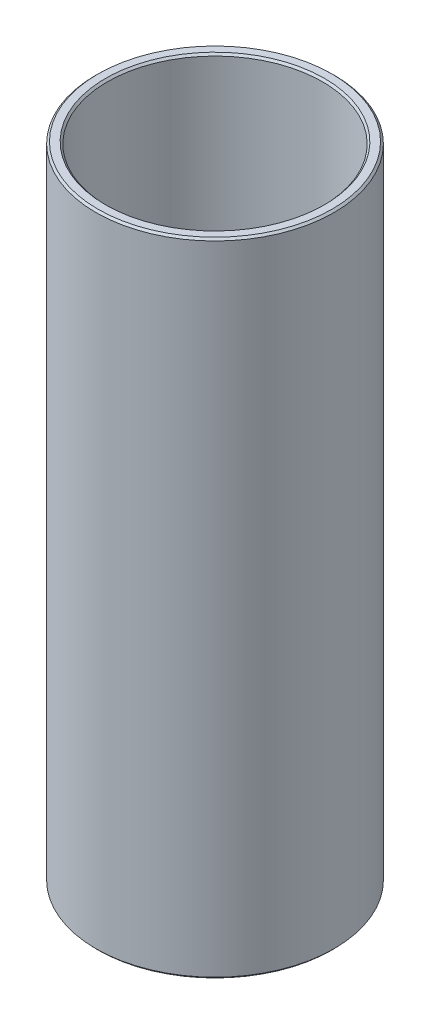
ISO-10303-21;
HEADER;
FILE_DESCRIPTION(('STEP AP214'),'2;1');
FILE_NAME('part.step','',(''),(''),'','','');
FILE_SCHEMA(('AUTOMOTIVE_DESIGN { 1 0 10303 214 1 1 1 1 }'));
ENDSEC;
DATA;
#1=APPLICATION_CONTEXT('core data for automotive mechanical design processes');
#2=APPLICATION_PROTOCOL_DEFINITION('international standard','automotive_design',2000,#1);
#3=PRODUCT_CONTEXT('',#1,'mechanical');
#4=PRODUCT('Part','Part','',(#3));
#5=PRODUCT_RELATED_PRODUCT_CATEGORY('part','',(#4));
#6=PRODUCT_DEFINITION_FORMATION('','',#4);
#7=PRODUCT_DEFINITION_CONTEXT('part definition',#1,'design');
#8=PRODUCT_DEFINITION('design','',#6,#7);
#9=PRODUCT_DEFINITION_SHAPE('','',#8);
#10=(LENGTH_UNIT() NAMED_UNIT(*) SI_UNIT(.MILLI.,.METRE.));
#11=(NAMED_UNIT(*) PLANE_ANGLE_UNIT() SI_UNIT($,.RADIAN.));
#12=(NAMED_UNIT(*) SI_UNIT($,.STERADIAN.) SOLID_ANGLE_UNIT());
#13=UNCERTAINTY_MEASURE_WITH_UNIT(LENGTH_MEASURE(1.E-05),#10,'distance_accuracy_value','');
#14=(GEOMETRIC_REPRESENTATION_CONTEXT(3) GLOBAL_UNCERTAINTY_ASSIGNED_CONTEXT((#13)) GLOBAL_UNIT_ASSIGNED_CONTEXT((#10,
#11,#12)) REPRESENTATION_CONTEXT('',''));
#15=CARTESIAN_POINT('',(0.,0.,0.));
#16=DIRECTION('',(0.,0.,1.));
#17=DIRECTION('',(1.,0.,0.));
#18=AXIS2_PLACEMENT_3D('',#15,#16,#17);
#19=CARTESIAN_POINT('',(0.,269.324814247525,0.));
#20=DIRECTION('',(0.,-1.,0.));
#21=DIRECTION('',(0.,0.,-1.));
#22=AXIS2_PLACEMENT_3D('',#19,#20,#21);
#23=CYLINDRICAL_SURFACE('',#22,50.);
#24=CARTESIAN_POINT('',(0.,0.845228539929521,0.));
#25=DIRECTION('',(0.,1.,0.));
#26=DIRECTION('',(0.,0.,1.));
#27=AXIS2_PLACEMENT_3D('',#24,#25,#26);
#28=CIRCLE('',#27,50.);
#29=CARTESIAN_POINT('',(0.,0.845228539929521,50.));
#30=VERTEX_POINT('',#29);
#31=EDGE_CURVE('E10',#30,#30,#28,.T.);
#32=ORIENTED_EDGE('',*,*,#31,.T.);
#33=EDGE_LOOP('',(#32));
#34=FACE_BOUND('',#33,.T.);
#35=CARTESIAN_POINT('',(0.,268.526705050286,0.));
#36=DIRECTION('',(0.,1.,0.));
#37=DIRECTION('',(0.,0.,1.));
#38=AXIS2_PLACEMENT_3D('',#35,#36,#37);
#39=CIRCLE('',#38,50.);
#40=CARTESIAN_POINT('',(0.,268.526705050286,-50.));
#41=VERTEX_POINT('',#40);
#42=EDGE_CURVE('E50',#41,#41,#39,.F.);
#43=ORIENTED_EDGE('',*,*,#42,.T.);
#44=EDGE_LOOP('',(#43));
#45=FACE_BOUND('',#44,.T.);
#46=ADVANCED_FACE('F39',(#34,#45),#23,.T.);
#47=CARTESIAN_POINT('',(0.,269.324814247525,0.));
#48=DIRECTION('',(0.,1.,0.));
#49=DIRECTION('',(0.,0.,1.));
#50=AXIS2_PLACEMENT_3D('',#47,#48,#49);
#51=PLANE('',#50);
#52=CARTESIAN_POINT('',(0.,269.324814247525,0.));
#53=DIRECTION('',(0.,1.,0.));
#54=DIRECTION('',(0.,0.,1.));
#55=AXIS2_PLACEMENT_3D('',#52,#53,#54);
#56=CIRCLE('',#55,45.9864678372641);
#57=CARTESIAN_POINT('',(0.,269.324814247525,45.986467837264));
#58=VERTEX_POINT('',#57);
#59=EDGE_CURVE('E58',#58,#58,#56,.F.);
#60=ORIENTED_EDGE('',*,*,#59,.T.);
#61=EDGE_LOOP('',(#60));
#62=FACE_BOUND('',#61,.T.);
#63=CARTESIAN_POINT('',(0.,269.324814247525,0.));
#64=DIRECTION('',(0.,1.,0.));
#65=DIRECTION('',(0.,0.,1.));
#66=AXIS2_PLACEMENT_3D('',#63,#64,#65);
#67=CIRCLE('',#66,49.1547714600705);
#68=CARTESIAN_POINT('',(0.,269.324814247525,-49.1547714600705));
#69=VERTEX_POINT('',#68);
#70=EDGE_CURVE('E61',#69,#69,#67,.T.);
#71=ORIENTED_EDGE('',*,*,#70,.T.);
#72=EDGE_LOOP('',(#71));
#73=FACE_BOUND('',#72,.T.);
#74=ADVANCED_FACE('F88',(#62,#73),#51,.T.);
#75=CARTESIAN_POINT('',(0.,0.,0.));
#76=DIRECTION('',(0.,1.,0.));
#77=DIRECTION('',(0.,0.,1.));
#78=AXIS2_PLACEMENT_3D('',#75,#76,#77);
#79=PLANE('',#78);
#80=CARTESIAN_POINT('',(0.,0.,0.));
#81=DIRECTION('',(0.,1.,0.));
#82=DIRECTION('',(0.,0.,1.));
#83=AXIS2_PLACEMENT_3D('',#80,#81,#82);
#84=CIRCLE('',#83,46.0335871799544);
#85=CARTESIAN_POINT('',(0.,0.,46.0335871799544));
#86=VERTEX_POINT('',#85);
#87=EDGE_CURVE('E51',#86,#86,#84,.T.);
#88=ORIENTED_EDGE('',*,*,#87,.T.);
#89=EDGE_LOOP('',(#88));
#90=FACE_BOUND('',#89,.T.);
#91=CARTESIAN_POINT('',(0.,0.,0.));
#92=DIRECTION('',(0.,1.,0.));
#93=DIRECTION('',(0.,0.,1.));
#94=AXIS2_PLACEMENT_3D('',#91,#92,#93);
#95=CIRCLE('',#94,49.2018908027608);
#96=CARTESIAN_POINT('',(0.,0.,49.2018908027608));
#97=VERTEX_POINT('',#96);
#98=EDGE_CURVE('E54',#97,#97,#95,.F.);
#99=ORIENTED_EDGE('',*,*,#98,.T.);
#100=EDGE_LOOP('',(#99));
#101=FACE_BOUND('',#100,.T.);
#102=ADVANCED_FACE('F83',(#90,#101),#79,.F.);
#103=CARTESIAN_POINT('',(0.,269.324814247525,0.));
#104=DIRECTION('',(0.,-1.,0.));
#105=DIRECTION('',(0.,0.,-1.));
#106=AXIS2_PLACEMENT_3D('',#103,#104,#105);
#107=CYLINDRICAL_SURFACE('',#106,45.1883586400248);
#108=CARTESIAN_POINT('',(0.,268.479585707596,0.));
#109=DIRECTION('',(0.,1.,0.));
#110=DIRECTION('',(0.,0.,1.));
#111=AXIS2_PLACEMENT_3D('',#108,#109,#110);
#112=CIRCLE('',#111,45.1883586400248);
#113=CARTESIAN_POINT('',(0.,268.479585707596,45.1883586400248));
#114=VERTEX_POINT('',#113);
#115=EDGE_CURVE('E67',#114,#114,#112,.T.);
#116=ORIENTED_EDGE('',*,*,#115,.T.);
#117=EDGE_LOOP('',(#116));
#118=FACE_BOUND('',#117,.T.);
#119=CARTESIAN_POINT('',(0.,0.798109197239161,0.));
#120=DIRECTION('',(0.,1.,0.));
#121=DIRECTION('',(0.,0.,1.));
#122=AXIS2_PLACEMENT_3D('',#119,#120,#121);
#123=CIRCLE('',#122,45.1883586400248);
#124=CARTESIAN_POINT('',(0.,0.798109197239161,45.1883586400248));
#125=VERTEX_POINT('',#124);
#126=EDGE_CURVE('E69',#125,#125,#123,.F.);
#127=ORIENTED_EDGE('',*,*,#126,.T.);
#128=EDGE_LOOP('',(#127));
#129=FACE_BOUND('',#128,.T.);
#130=ADVANCED_FACE('F71',(#118,#129),#107,.F.);
#131=CARTESIAN_POINT('',(0.,268.479585707596,0.));
#132=DIRECTION('',(0.,1.,0.));
#133=DIRECTION('',(0.,0.,1.));
#134=AXIS2_PLACEMENT_3D('',#131,#132,#133);
#135=CONICAL_SURFACE('',#134,45.1883586400248,0.756733066064484);
#136=CARTESIAN_POINT('',(0.,269.324814247525,45.986467837264));
#137=CARTESIAN_POINT('',(0.,269.316009783568,45.9781541997928));
#138=CARTESIAN_POINT('',(0.,269.30720531961,45.9698405623216));
#139=CARTESIAN_POINT('',(0.,269.289596391695,45.9532132873791));
#140=CARTESIAN_POINT('',(0.,269.280791927737,45.9448996499078));
#141=CARTESIAN_POINT('',(0.,269.263182999822,45.9282723749654));
#142=CARTESIAN_POINT('',(0.,269.254378535865,45.9199587374941));
#143=CARTESIAN_POINT('',(0.,269.236769607949,45.9033314625516));
#144=CARTESIAN_POINT('',(0.,269.227965143992,45.8950178250804));
#145=CARTESIAN_POINT('',(0.,269.210356216077,45.8783905501379));
#146=CARTESIAN_POINT('',(0.,269.201551752119,45.8700769126667));
#147=CARTESIAN_POINT('',(0.,269.183942824204,45.8534496377242));
#148=CARTESIAN_POINT('',(0.,269.175138360246,45.8451360002529));
#149=CARTESIAN_POINT('',(0.,269.157529432331,45.8285087253104));
#150=CARTESIAN_POINT('',(0.,269.148724968373,45.8201950878392));
#151=CARTESIAN_POINT('',(0.,269.131116040458,45.8035678128967));
#152=CARTESIAN_POINT('',(0.,269.122311576501,45.7952541754255));
#153=CARTESIAN_POINT('',(0.,269.104702648585,45.778626900483));
#154=CARTESIAN_POINT('',(0.,269.095898184628,45.7703132630117));
#155=CARTESIAN_POINT('',(0.,269.078289256713,45.7536859880693));
#156=CARTESIAN_POINT('',(0.,269.069484792755,45.745372350598));
#157=CARTESIAN_POINT('',(0.,269.05187586484,45.7287450756555));
#158=CARTESIAN_POINT('',(0.,269.043071400882,45.7204314381843));
#159=CARTESIAN_POINT('',(0.,269.025462472967,45.7038041632418));
#160=CARTESIAN_POINT('',(0.,269.016658009009,45.6954905257706));
#161=CARTESIAN_POINT('',(0.,268.999049081094,45.6788632508281));
#162=CARTESIAN_POINT('',(0.,268.990244617137,45.6705496133568));
#163=CARTESIAN_POINT('',(0.,268.972635689221,45.6539223384144));
#164=CARTESIAN_POINT('',(0.,268.963831225264,45.6456087009431));
#165=CARTESIAN_POINT('',(0.,268.946222297349,45.6289814260006));
#166=CARTESIAN_POINT('',(0.,268.937417833391,45.6206677885294));
#167=CARTESIAN_POINT('',(0.,268.919808905476,45.6040405135869));
#168=CARTESIAN_POINT('',(0.,268.911004441518,45.5957268761157));
#169=CARTESIAN_POINT('',(0.,268.893395513603,45.5790996011732));
#170=CARTESIAN_POINT('',(0.,268.884591049645,45.5707859637019));
#171=CARTESIAN_POINT('',(0.,268.86698212173,45.5541586887595));
#172=CARTESIAN_POINT('',(0.,268.858177657773,45.5458450512882));
#173=CARTESIAN_POINT('',(0.,268.840568729857,45.5292177763457));
#174=CARTESIAN_POINT('',(0.,268.8317642659,45.5209041388745));
#175=CARTESIAN_POINT('',(0.,268.814155337985,45.504276863932));
#176=CARTESIAN_POINT('',(0.,268.805350874027,45.4959632264608));
#177=CARTESIAN_POINT('',(0.,268.787741946112,45.4793359515183));
#178=CARTESIAN_POINT('',(0.,268.778937482154,45.471022314047));
#179=CARTESIAN_POINT('',(0.,268.761328554239,45.4543950391045));
#180=CARTESIAN_POINT('',(0.,268.752524090281,45.4460814016333));
#181=CARTESIAN_POINT('',(0.,268.734915162366,45.4294541266908));
#182=CARTESIAN_POINT('',(0.,268.726110698409,45.4211404892196));
#183=CARTESIAN_POINT('',(0.,268.708501770493,45.4045132142771));
#184=CARTESIAN_POINT('',(0.,268.699697306536,45.3961995768058));
#185=CARTESIAN_POINT('',(0.,268.682088378621,45.3795723018634));
#186=CARTESIAN_POINT('',(0.,268.673283914663,45.3712586643921));
#187=CARTESIAN_POINT('',(0.,268.655674986748,45.3546313894496));
#188=CARTESIAN_POINT('',(0.,268.64687052279,45.3463177519784));
#189=CARTESIAN_POINT('',(0.,268.629261594875,45.3296904770359));
#190=CARTESIAN_POINT('',(0.,268.620457130917,45.3213768395647));
#191=CARTESIAN_POINT('',(0.,268.602848203002,45.3047495646222));
#192=CARTESIAN_POINT('',(0.,268.594043739045,45.296435927151));
#193=CARTESIAN_POINT('',(0.,268.576434811129,45.2798086522085));
#194=CARTESIAN_POINT('',(0.,268.567630347172,45.2714950147372));
#195=CARTESIAN_POINT('',(0.,268.550021419257,45.2548677397947));
#196=CARTESIAN_POINT('',(0.,268.541216955299,45.2465541023235));
#197=CARTESIAN_POINT('',(0.,268.523608027384,45.229926827381));
#198=CARTESIAN_POINT('',(0.,268.514803563426,45.2216131899098));
#199=CARTESIAN_POINT('',(0.,268.497194635511,45.2049859149673));
#200=CARTESIAN_POINT('',(0.,268.488390171553,45.196672277496));
#201=CARTESIAN_POINT('',(0.,268.479585707596,45.1883586400248));
#202=B_SPLINE_CURVE_WITH_KNOTS('',3,(#136,#137,#138,#139,#140,#141,#142,#143,#144,#145,#146,
#147,#148,#149,#150,#151,#152,#153,#154,#155,#156,#157,#158,#159,#160,#161,#162,#163,#164,#165,
#166,#167,#168,#169,#170,#171,#172,#173,#174,#175,#176,#177,#178,#179,#180,#181,#182,#183,#184,
#185,#186,#187,#188,#189,#190,#191,#192,#193,#194,#195,#196,#197,#198,#199,#200,#201),
.UNSPECIFIED.,.F.,.F.,(4,2,2,2,2,2,2,2,2,2,2,2,2,2,2,2,2,2,2,2,2,2,2,2,2,2,2,2,2,2,2,2,4),(0.,
0.0363279008787035,0.0726558017574521,0.108983702636201,0.145311603514904,0.181639504393653,
0.217967405272401,0.254295306151145,0.290623207029853,0.326951107908602,0.363279008787346,
0.399606909666054,0.435934810544803,0.472262711423547,0.508590612302295,0.544918513181003,
0.581246414059747,0.617574314938496,0.653902215817204,0.690230116695948,0.726558017574697,
0.762885918453445,0.799213819332149,0.835541720210897,0.871869621089646,0.90819752196835,
0.944525422847098,0.980853323725842,1.01718122460459,1.0535091254833,1.08983702636204,
1.12616492724079,1.1624928281195),.UNSPECIFIED.);
#203=EDGE_CURVE('BSEAM77',#58,#114,#202,.T.);
#204=ORIENTED_EDGE('',*,*,#59,.F.);
#205=ORIENTED_EDGE('',*,*,#115,.F.);
#206=ORIENTED_EDGE('',*,*,#203,.T.);
#207=ORIENTED_EDGE('',*,*,#203,.F.);
#208=EDGE_LOOP('',(#204,#206,#205,#207));
#209=FACE_BOUND('',#208,.T.);
#210=ADVANCED_FACE('F77',(#209),#135,.F.);
#211=CARTESIAN_POINT('',(0.,0.,0.));
#212=DIRECTION('',(0.,-1.,0.));
#213=DIRECTION('',(0.,0.,-1.));
#214=AXIS2_PLACEMENT_3D('',#211,#212,#213);
#215=CONICAL_SURFACE('',#214,46.0335871799544,0.814063260730456);
#216=ORIENTED_EDGE('',*,*,#126,.F.);
#217=EDGE_LOOP('',(#216));
#218=FACE_BOUND('',#217,.T.);
#219=ORIENTED_EDGE('',*,*,#87,.F.);
#220=EDGE_LOOP('',(#219));
#221=FACE_BOUND('',#220,.T.);
#222=ADVANCED_FACE('F73',(#218,#221),#215,.F.);
#223=CARTESIAN_POINT('',(0.,0.845228539929521,0.));
#224=DIRECTION('',(0.,1.,0.));
#225=DIRECTION('',(0.,0.,1.));
#226=AXIS2_PLACEMENT_3D('',#223,#224,#225);
#227=CONICAL_SURFACE('',#226,50.,0.756733066064487);
#228=ORIENTED_EDGE('',*,*,#98,.F.);
#229=EDGE_LOOP('',(#228));
#230=FACE_BOUND('',#229,.T.);
#231=ORIENTED_EDGE('',*,*,#31,.F.);
#232=EDGE_LOOP('',(#231));
#233=FACE_BOUND('',#232,.T.);
#234=ADVANCED_FACE('F76',(#230,#233),#227,.T.);
#235=CARTESIAN_POINT('',(0.,269.324814247525,0.));
#236=DIRECTION('',(0.,-1.,0.));
#237=DIRECTION('',(0.,0.,-1.));
#238=AXIS2_PLACEMENT_3D('',#235,#236,#237);
#239=CONICAL_SURFACE('',#238,49.1547714600705,0.814063260730458);
#240=CARTESIAN_POINT('',(0.,268.526705050286,-50.));
#241=CARTESIAN_POINT('',(0.,268.535018687757,-49.9911955360424));
#242=CARTESIAN_POINT('',(0.,268.543332325229,-49.9823910720848));
#243=CARTESIAN_POINT('',(0.,268.559959600171,-49.9647821441696));
#244=CARTESIAN_POINT('',(0.,268.568273237642,-49.955977680212));
#245=CARTESIAN_POINT('',(0.,268.584900512585,-49.9383687522968));
#246=CARTESIAN_POINT('',(0.,268.593214150056,-49.9295642883392));
#247=CARTESIAN_POINT('',(0.,268.609841424999,-49.911955360424));
#248=CARTESIAN_POINT('',(0.,268.61815506247,-49.9031508964664));
#249=CARTESIAN_POINT('',(0.,268.634782337412,-49.8855419685512));
#250=CARTESIAN_POINT('',(0.,268.643095974884,-49.8767375045936));
#251=CARTESIAN_POINT('',(0.,268.659723249826,-49.8591285766785));
#252=CARTESIAN_POINT('',(0.,268.668036887297,-49.8503241127208));
#253=CARTESIAN_POINT('',(0.,268.68466416224,-49.8327151848057));
#254=CARTESIAN_POINT('',(0.,268.692977799711,-49.8239107208481));
#255=CARTESIAN_POINT('',(0.,268.709605074654,-49.8063017929329));
#256=CARTESIAN_POINT('',(0.,268.717918712125,-49.7974973289753));
#257=CARTESIAN_POINT('',(0.,268.734545987067,-49.7798884010601));
#258=CARTESIAN_POINT('',(0.,268.742859624539,-49.7710839371025));
#259=CARTESIAN_POINT('',(0.,268.759486899481,-49.7534750091873));
#260=CARTESIAN_POINT('',(0.,268.767800536952,-49.7446705452297));
#261=CARTESIAN_POINT('',(0.,268.784427811895,-49.7270616173145));
#262=CARTESIAN_POINT('',(0.,268.792741449366,-49.7182571533569));
#263=CARTESIAN_POINT('',(0.,268.809368724308,-49.7006482254417));
#264=CARTESIAN_POINT('',(0.,268.81768236178,-49.6918437614841));
#265=CARTESIAN_POINT('',(0.,268.834309636722,-49.6742348335689));
#266=CARTESIAN_POINT('',(0.,268.842623274193,-49.6654303696113));
#267=CARTESIAN_POINT('',(0.,268.859250549136,-49.6478214416961));
#268=CARTESIAN_POINT('',(0.,268.867564186607,-49.6390169777385));
#269=CARTESIAN_POINT('',(0.,268.88419146155,-49.6214080498233));
#270=CARTESIAN_POINT('',(0.,268.892505099021,-49.6126035858657));
#271=CARTESIAN_POINT('',(0.,268.909132373963,-49.5949946579505));
#272=CARTESIAN_POINT('',(0.,268.917446011435,-49.5861901939929));
#273=CARTESIAN_POINT('',(0.,268.934073286377,-49.5685812660777));
#274=CARTESIAN_POINT('',(0.,268.942386923848,-49.5597768021201));
#275=CARTESIAN_POINT('',(0.,268.959014198791,-49.5421678742049));
#276=CARTESIAN_POINT('',(0.,268.967327836262,-49.5333634102473));
#277=CARTESIAN_POINT('',(0.,268.983955111204,-49.5157544823321));
#278=CARTESIAN_POINT('',(0.,268.992268748676,-49.5069500183745));
#279=CARTESIAN_POINT('',(0.,269.008896023618,-49.4893410904593));
#280=CARTESIAN_POINT('',(0.,269.01720966109,-49.4805366265017));
#281=CARTESIAN_POINT('',(0.,269.033836936032,-49.4629276985865));
#282=CARTESIAN_POINT('',(0.,269.042150573503,-49.4541232346289));
#283=CARTESIAN_POINT('',(0.,269.058777848446,-49.4365143067137));
#284=CARTESIAN_POINT('',(0.,269.067091485917,-49.4277098427561));
#285=CARTESIAN_POINT('',(0.,269.083718760859,-49.4101009148409));
#286=CARTESIAN_POINT('',(0.,269.092032398331,-49.4012964508833));
#287=CARTESIAN_POINT('',(0.,269.108659673273,-49.3836875229681));
#288=CARTESIAN_POINT('',(0.,269.116973310744,-49.3748830590105));
#289=CARTESIAN_POINT('',(0.,269.133600585687,-49.3572741310953));
#290=CARTESIAN_POINT('',(0.,269.141914223158,-49.3484696671377));
#291=CARTESIAN_POINT('',(0.,269.158541498101,-49.3308607392225));
#292=CARTESIAN_POINT('',(0.,269.166855135572,-49.3220562752649));
#293=CARTESIAN_POINT('',(0.,269.183482410514,-49.3044473473497));
#294=CARTESIAN_POINT('',(0.,269.191796047986,-49.2956428833921));
#295=CARTESIAN_POINT('',(0.,269.208423322928,-49.2780339554769));
#296=CARTESIAN_POINT('',(0.,269.216736960399,-49.2692294915193));
#297=CARTESIAN_POINT('',(0.,269.233364235342,-49.2516205636041));
#298=CARTESIAN_POINT('',(0.,269.241677872813,-49.2428160996465));
#299=CARTESIAN_POINT('',(0.,269.258305147755,-49.2252071717313));
#300=CARTESIAN_POINT('',(0.,269.266618785227,-49.2164027077737));
#301=CARTESIAN_POINT('',(0.,269.283246060169,-49.1987937798585));
#302=CARTESIAN_POINT('',(0.,269.29155969764,-49.1899893159009));
#303=CARTESIAN_POINT('',(0.,269.308186972583,-49.1723803879857));
#304=CARTESIAN_POINT('',(0.,269.316500610054,-49.1635759240281));
#305=CARTESIAN_POINT('',(0.,269.324814247525,-49.1547714600705));
#306=B_SPLINE_CURVE_WITH_KNOTS('',3,(#240,#241,#242,#243,#244,#245,#246,#247,#248,#249,#250,
#251,#252,#253,#254,#255,#256,#257,#258,#259,#260,#261,#262,#263,#264,#265,#266,#267,#268,#269,
#270,#271,#272,#273,#274,#275,#276,#277,#278,#279,#280,#281,#282,#283,#284,#285,#286,#287,#288,
#289,#290,#291,#292,#293,#294,#295,#296,#297,#298,#299,#300,#301,#302,#303,#304,#305),
.UNSPECIFIED.,.F.,.F.,(4,2,2,2,2,2,2,2,2,2,2,2,2,2,2,2,2,2,2,2,2,2,2,2,2,2,2,2,2,2,2,2,4),(0.,
0.0363279008787335,0.072655801757472,0.108983702636205,0.145311603514939,0.181639504393677,
0.217967405272411,0.254295306151149,0.290623207029845,0.326951107908578,0.363279008787317,
0.39960690966605,0.435934810544789,0.472262711423522,0.508590612302256,0.544918513180994,
0.58124641405969,0.617574314938428,0.653902215817162,0.690230116695895,0.726558017574634,
0.762885918453367,0.799213819332106,0.835541720210839,0.871869621089578,0.908197521968273,
0.944525422847006,0.980853323725745,1.01718122460448,1.05350912548322,1.08983702636195,
1.12616492724068,1.16249282811942),.UNSPECIFIED.);
#307=EDGE_CURVE('BSEAM45',#41,#69,#306,.T.);
#308=ORIENTED_EDGE('',*,*,#42,.F.);
#309=ORIENTED_EDGE('',*,*,#70,.F.);
#310=ORIENTED_EDGE('',*,*,#307,.T.);
#311=ORIENTED_EDGE('',*,*,#307,.F.);
#312=EDGE_LOOP('',(#308,#310,#309,#311));
#313=FACE_BOUND('',#312,.T.);
#314=ADVANCED_FACE('F45',(#313),#239,.T.);
#315=CLOSED_SHELL('',(#46,#74,#102,#130,#210,#222,#234,#314));
#316=MANIFOLD_SOLID_BREP('B2',#315);
#317=ADVANCED_BREP_SHAPE_REPRESENTATION('',(#18,#316),#14);
#318=SHAPE_DEFINITION_REPRESENTATION(#9,#317);
ENDSEC;
END-ISO-10303-21;
